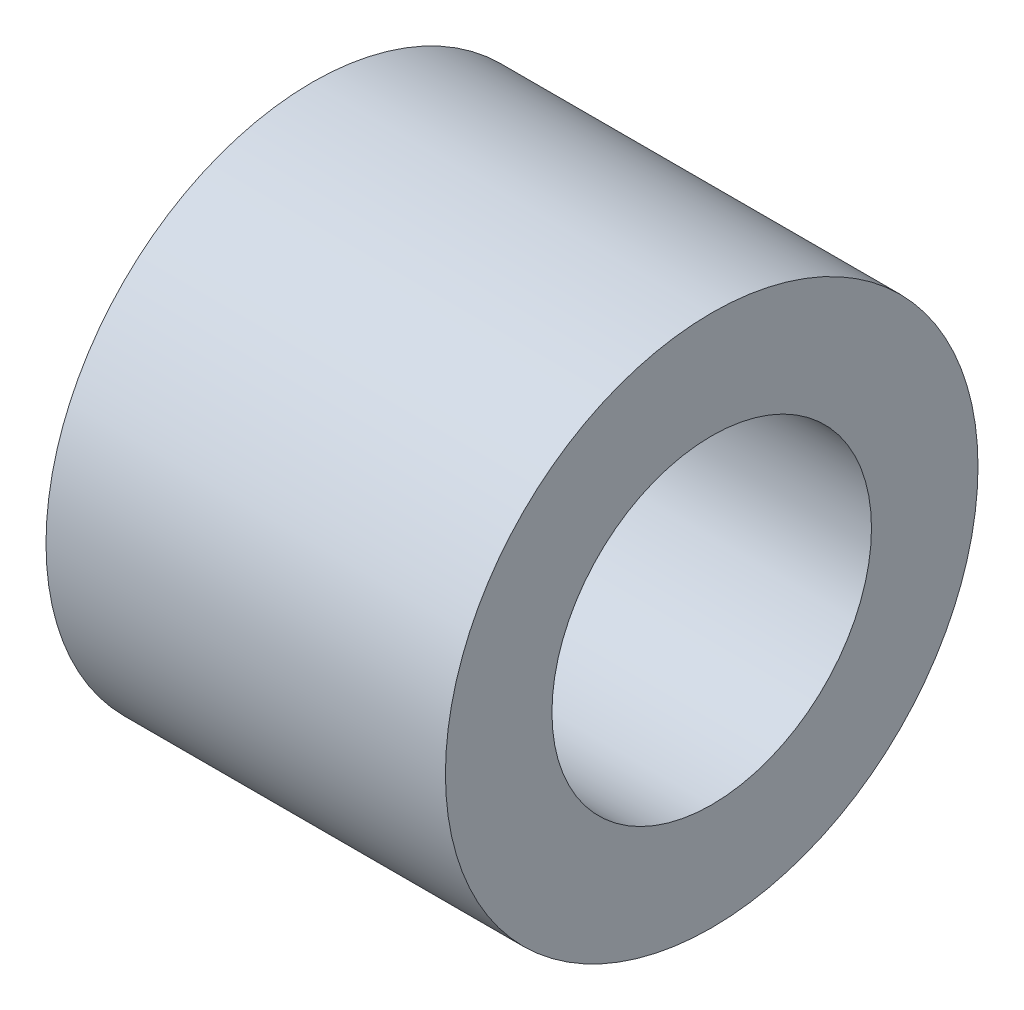
ISO-10303-21;
HEADER;
FILE_DESCRIPTION(('STEP AP214'),'2;1');
FILE_NAME('part.step','',(''),(''),'','','');
FILE_SCHEMA(('AUTOMOTIVE_DESIGN { 1 0 10303 214 1 1 1 1 }'));
ENDSEC;
DATA;
#1=APPLICATION_CONTEXT('core data for automotive mechanical design processes');
#2=APPLICATION_PROTOCOL_DEFINITION('international standard','automotive_design',2000,#1);
#3=PRODUCT_CONTEXT('',#1,'mechanical');
#4=PRODUCT('Part','Part','',(#3));
#5=PRODUCT_RELATED_PRODUCT_CATEGORY('part','',(#4));
#6=PRODUCT_DEFINITION_FORMATION('','',#4);
#7=PRODUCT_DEFINITION_CONTEXT('part definition',#1,'design');
#8=PRODUCT_DEFINITION('design','',#6,#7);
#9=PRODUCT_DEFINITION_SHAPE('','',#8);
#10=(LENGTH_UNIT() NAMED_UNIT(*) SI_UNIT(.MILLI.,.METRE.));
#11=(NAMED_UNIT(*) PLANE_ANGLE_UNIT() SI_UNIT($,.RADIAN.));
#12=(NAMED_UNIT(*) SI_UNIT($,.STERADIAN.) SOLID_ANGLE_UNIT());
#13=UNCERTAINTY_MEASURE_WITH_UNIT(LENGTH_MEASURE(1.E-05),#10,'distance_accuracy_value','');
#14=(GEOMETRIC_REPRESENTATION_CONTEXT(3) GLOBAL_UNCERTAINTY_ASSIGNED_CONTEXT((#13)) GLOBAL_UNIT_ASSIGNED_CONTEXT((#10,
#11,#12)) REPRESENTATION_CONTEXT('',''));
#15=CARTESIAN_POINT('',(0.,0.,0.));
#16=DIRECTION('',(0.,0.,1.));
#17=DIRECTION('',(1.,0.,0.));
#18=AXIS2_PLACEMENT_3D('',#15,#16,#17);
#19=CARTESIAN_POINT('',(19.05,0.,0.));
#20=DIRECTION('',(1.,0.,0.));
#21=DIRECTION('',(0.,0.,-1.));
#22=AXIS2_PLACEMENT_3D('',#19,#20,#21);
#23=PLANE('',#22);
#24=CARTESIAN_POINT('',(19.05,0.,0.));
#25=DIRECTION('',(1.,0.,0.));
#26=DIRECTION('',(0.,0.,-1.));
#27=AXIS2_PLACEMENT_3D('',#24,#25,#26);
#28=CIRCLE('',#27,12.7);
#29=CARTESIAN_POINT('',(19.05,0.,-12.7));
#30=VERTEX_POINT('',#29);
#31=EDGE_CURVE('E10',#30,#30,#28,.T.);
#32=ORIENTED_EDGE('',*,*,#31,.T.);
#33=EDGE_LOOP('',(#32));
#34=FACE_BOUND('',#33,.T.);
#35=CARTESIAN_POINT('',(19.05,0.,0.));
#36=DIRECTION('',(1.,0.,0.));
#37=DIRECTION('',(0.,0.,-1.));
#38=AXIS2_PLACEMENT_3D('',#35,#36,#37);
#39=CIRCLE('',#38,7.62);
#40=CARTESIAN_POINT('',(19.05,0.,-7.62));
#41=VERTEX_POINT('',#40);
#42=EDGE_CURVE('E42',#41,#41,#39,.T.);
#43=ORIENTED_EDGE('',*,*,#42,.F.);
#44=EDGE_LOOP('',(#43));
#45=FACE_BOUND('',#44,.T.);
#46=ADVANCED_FACE('F31',(#34,#45),#23,.T.);
#47=CARTESIAN_POINT('',(0.,0.,0.));
#48=DIRECTION('',(1.,0.,0.));
#49=DIRECTION('',(0.,0.,-1.));
#50=AXIS2_PLACEMENT_3D('',#47,#48,#49);
#51=PLANE('',#50);
#52=CARTESIAN_POINT('',(0.,0.,0.));
#53=DIRECTION('',(1.,0.,0.));
#54=DIRECTION('',(0.,0.,-1.));
#55=AXIS2_PLACEMENT_3D('',#52,#53,#54);
#56=CIRCLE('',#55,12.7);
#57=CARTESIAN_POINT('',(0.,0.,-12.7));
#58=VERTEX_POINT('',#57);
#59=EDGE_CURVE('E35',#58,#58,#56,.T.);
#60=ORIENTED_EDGE('',*,*,#59,.F.);
#61=EDGE_LOOP('',(#60));
#62=FACE_BOUND('',#61,.T.);
#63=CARTESIAN_POINT('',(0.,0.,0.));
#64=DIRECTION('',(1.,0.,0.));
#65=DIRECTION('',(0.,0.,-1.));
#66=AXIS2_PLACEMENT_3D('',#63,#64,#65);
#67=CIRCLE('',#66,7.62);
#68=CARTESIAN_POINT('',(0.,0.,-7.62));
#69=VERTEX_POINT('',#68);
#70=EDGE_CURVE('E44',#69,#69,#67,.T.);
#71=ORIENTED_EDGE('',*,*,#70,.T.);
#72=EDGE_LOOP('',(#71));
#73=FACE_BOUND('',#72,.T.);
#74=ADVANCED_FACE('F54',(#62,#73),#51,.F.);
#75=CARTESIAN_POINT('',(19.05,0.,0.));
#76=DIRECTION('',(-1.,0.,0.));
#77=DIRECTION('',(0.,0.,1.));
#78=AXIS2_PLACEMENT_3D('',#75,#76,#77);
#79=CYLINDRICAL_SURFACE('',#78,12.7);
#80=ORIENTED_EDGE('',*,*,#31,.F.);
#81=EDGE_LOOP('',(#80));
#82=FACE_BOUND('',#81,.T.);
#83=ORIENTED_EDGE('',*,*,#59,.T.);
#84=EDGE_LOOP('',(#83));
#85=FACE_BOUND('',#84,.T.);
#86=ADVANCED_FACE('F33',(#82,#85),#79,.T.);
#87=CARTESIAN_POINT('',(19.05,0.,0.));
#88=DIRECTION('',(-1.,0.,0.));
#89=DIRECTION('',(0.,0.,1.));
#90=AXIS2_PLACEMENT_3D('',#87,#88,#89);
#91=CYLINDRICAL_SURFACE('',#90,7.62);
#92=ORIENTED_EDGE('',*,*,#42,.T.);
#93=EDGE_LOOP('',(#92));
#94=FACE_BOUND('',#93,.T.);
#95=ORIENTED_EDGE('',*,*,#70,.F.);
#96=EDGE_LOOP('',(#95));
#97=FACE_BOUND('',#96,.T.);
#98=ADVANCED_FACE('F50',(#94,#97),#91,.F.);
#99=CLOSED_SHELL('',(#46,#74,#86,#98));
#100=MANIFOLD_SOLID_BREP('B2',#99);
#101=ADVANCED_BREP_SHAPE_REPRESENTATION('',(#18,#100),#14);
#102=SHAPE_DEFINITION_REPRESENTATION(#9,#101);
ENDSEC;
END-ISO-10303-21;
